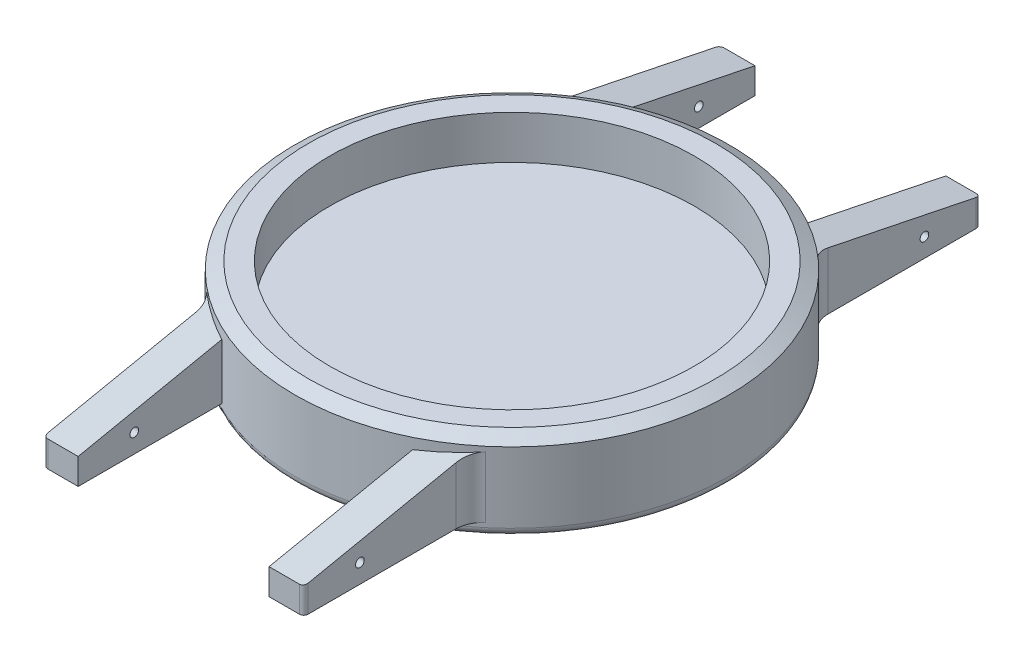
ISO-10303-21;
HEADER;
FILE_DESCRIPTION(('STEP AP214'),'2;1');
FILE_NAME('part.step','',(''),(''),'','','');
FILE_SCHEMA(('AUTOMOTIVE_DESIGN { 1 0 10303 214 1 1 1 1 }'));
ENDSEC;
DATA;
#1=APPLICATION_CONTEXT('core data for automotive mechanical design processes');
#2=APPLICATION_PROTOCOL_DEFINITION('international standard','automotive_design',2000,#1);
#3=PRODUCT_CONTEXT('',#1,'mechanical');
#4=PRODUCT('Part','Part','',(#3));
#5=PRODUCT_RELATED_PRODUCT_CATEGORY('part','',(#4));
#6=PRODUCT_DEFINITION_FORMATION('','',#4);
#7=PRODUCT_DEFINITION_CONTEXT('part definition',#1,'design');
#8=PRODUCT_DEFINITION('design','',#6,#7);
#9=PRODUCT_DEFINITION_SHAPE('','',#8);
#10=(LENGTH_UNIT() NAMED_UNIT(*) SI_UNIT(.MILLI.,.METRE.));
#11=(NAMED_UNIT(*) PLANE_ANGLE_UNIT() SI_UNIT($,.RADIAN.));
#12=(NAMED_UNIT(*) SI_UNIT($,.STERADIAN.) SOLID_ANGLE_UNIT());
#13=UNCERTAINTY_MEASURE_WITH_UNIT(LENGTH_MEASURE(1.E-05),#10,'distance_accuracy_value','');
#14=(GEOMETRIC_REPRESENTATION_CONTEXT(3) GLOBAL_UNCERTAINTY_ASSIGNED_CONTEXT((#13)) GLOBAL_UNIT_ASSIGNED_CONTEXT((#10,
#11,#12)) REPRESENTATION_CONTEXT('',''));
#15=CARTESIAN_POINT('',(0.,0.,0.));
#16=DIRECTION('',(0.,0.,1.));
#17=DIRECTION('',(1.,0.,0.));
#18=AXIS2_PLACEMENT_3D('',#15,#16,#17);
#19=CARTESIAN_POINT('',(-30.,-17.,-78.));
#20=DIRECTION('',(0.,-1.,0.));
#21=DIRECTION('',(0.,0.,-1.));
#22=AXIS2_PLACEMENT_3D('',#19,#20,#21);
#23=PLANE('',#22);
#24=DIRECTION('',(0.,0.,-1.));
#25=VECTOR('',#24,1.);
#26=CARTESIAN_POINT('',(-30.,-17.,-78.));
#27=LINE('',#26,#25);
#28=CARTESIAN_POINT('',(-30.,-17.,-42.8952211790544));
#29=VERTEX_POINT('',#28);
#30=CARTESIAN_POINT('',(-30.,-17.,-77.));
#31=VERTEX_POINT('',#30);
#32=EDGE_CURVE('E236',#29,#31,#27,.T.);
#33=ORIENTED_EDGE('',*,*,#32,.T.);
#34=CARTESIAN_POINT('',(-29.,-17.,-77.));
#35=DIRECTION('',(0.,-1.,0.));
#36=DIRECTION('',(0.,0.,-1.));
#37=AXIS2_PLACEMENT_3D('',#34,#35,#36);
#38=CIRCLE('',#37,1.);
#39=CARTESIAN_POINT('',(-29.,-17.,-78.));
#40=VERTEX_POINT('',#39);
#41=EDGE_CURVE('E11',#31,#40,#38,.T.);
#42=ORIENTED_EDGE('',*,*,#41,.T.);
#43=DIRECTION('',(1.,0.,0.));
#44=VECTOR('',#43,1.);
#45=CARTESIAN_POINT('',(-30.,-17.,-78.));
#46=LINE('',#45,#44);
#47=CARTESIAN_POINT('',(-22.,-17.,-78.));
#48=VERTEX_POINT('',#47);
#49=EDGE_CURVE('E245',#40,#48,#46,.T.);
#50=ORIENTED_EDGE('',*,*,#49,.T.);
#51=DIRECTION('',(0.,0.,-1.));
#52=VECTOR('',#51,1.);
#53=CARTESIAN_POINT('',(-22.,-17.,-78.));
#54=LINE('',#53,#52);
#55=CARTESIAN_POINT('',(-22.,-17.,-44.8998886412873));
#56=VERTEX_POINT('',#55);
#57=EDGE_CURVE('E405',#56,#48,#54,.T.);
#58=ORIENTED_EDGE('',*,*,#57,.F.);
#59=CARTESIAN_POINT('',(0.,-17.,0.));
#60=DIRECTION('',(0.,-1.,0.));
#61=DIRECTION('',(0.,0.,-1.));
#62=AXIS2_PLACEMENT_3D('',#59,#60,#61);
#63=CIRCLE('',#62,50.);
#64=CARTESIAN_POINT('',(-32.1428571428571,-17.,-38.2993046241558));
#65=VERTEX_POINT('',#64);
#66=EDGE_CURVE('E250',#56,#65,#63,.F.);
#67=ORIENTED_EDGE('',*,*,#66,.T.);
#68=CARTESIAN_POINT('',(-36.,-17.,-42.8952211790544));
#69=DIRECTION('',(0.,-1.,0.));
#70=DIRECTION('',(0.,0.,-1.));
#71=AXIS2_PLACEMENT_3D('',#68,#69,#70);
#72=CIRCLE('',#71,6.);
#73=EDGE_CURVE('E316',#65,#29,#72,.F.);
#74=ORIENTED_EDGE('',*,*,#73,.T.);
#75=EDGE_LOOP('',(#33,#42,#50,#58,#67,#74));
#76=FACE_BOUND('',#75,.T.);
#77=ADVANCED_FACE('F36',(#76),#23,.T.);
#78=CARTESIAN_POINT('',(-30.,-11.,-78.));
#79=DIRECTION('',(0.,0.979533569786248,-0.201280862631819));
#80=DIRECTION('',(0.,0.201280862631819,0.979533569786248));
#81=AXIS2_PLACEMENT_3D('',#78,#79,#80);
#82=PLANE('',#81);
#83=DIRECTION('',(1.,0.,0.));
#84=VECTOR('',#83,1.);
#85=CARTESIAN_POINT('',(-30.,-11.,-78.));
#86=LINE('',#85,#84);
#87=CARTESIAN_POINT('',(-29.,-11.,-78.));
#88=VERTEX_POINT('',#87);
#89=CARTESIAN_POINT('',(-22.,-11.,-78.));
#90=VERTEX_POINT('',#89);
#91=EDGE_CURVE('E241',#88,#90,#86,.T.);
#92=ORIENTED_EDGE('',*,*,#91,.F.);
#93=CARTESIAN_POINT('',(-29.,-10.7945135635568,-77.));
#94=DIRECTION('',(0.,0.979533569786248,-0.201280862631819));
#95=DIRECTION('',(0.,0.201280862631819,0.979533569786248));
#96=AXIS2_PLACEMENT_3D('',#93,#94,#95);
#97=ELLIPSE('',#96,1.02089405697267,1.);
#98=CARTESIAN_POINT('',(-30.,-10.7945135635568,-77.));
#99=VERTEX_POINT('',#98);
#100=EDGE_CURVE('E60',#88,#99,#97,.T.);
#101=ORIENTED_EDGE('',*,*,#100,.T.);
#102=DIRECTION('',(0.,0.201280862631819,0.979533569786248));
#103=VECTOR('',#102,1.);
#104=CARTESIAN_POINT('',(-30.,-11.,-78.));
#105=LINE('',#104,#103);
#106=CARTESIAN_POINT('',(-30.,-3.78644409795873,-42.8952211790544));
#107=VERTEX_POINT('',#106);
#108=EDGE_CURVE('E238',#99,#107,#105,.T.);
#109=ORIENTED_EDGE('',*,*,#108,.T.);
#110=CARTESIAN_POINT('',(-36.,-3.78644409795873,-42.8952211790544));
#111=DIRECTION('',(0.,0.979533569786248,-0.201280862631819));
#112=DIRECTION('',(0.,0.201280862631819,0.979533569786248));
#113=AXIS2_PLACEMENT_3D('',#110,#111,#112);
#114=ELLIPSE('',#113,6.12536434183599,6.);
#115=CARTESIAN_POINT('',(-32.1428571428571,-2.8420455829025,-38.2993046241558));
#116=VERTEX_POINT('',#115);
#117=EDGE_CURVE('E313',#107,#116,#114,.F.);
#118=ORIENTED_EDGE('',*,*,#117,.T.);
#119=CARTESIAN_POINT('',(0.,5.02794204256612,0.));
#120=DIRECTION('',(0.,0.979533569786248,-0.201280862631819));
#121=DIRECTION('',(0.,0.201280862631819,0.979533569786248));
#122=AXIS2_PLACEMENT_3D('',#119,#120,#121);
#123=ELLIPSE('',#122,51.0447028486332,50.);
#124=CARTESIAN_POINT('',(-22.,-4.1983760710265,-44.8998886412873));
#125=VERTEX_POINT('',#124);
#126=EDGE_CURVE('E247',#116,#125,#123,.F.);
#127=ORIENTED_EDGE('',*,*,#126,.T.);
#128=DIRECTION('',(0.,0.201280862631819,0.979533569786248));
#129=VECTOR('',#128,1.);
#130=CARTESIAN_POINT('',(-22.,-11.,-78.));
#131=LINE('',#130,#129);
#132=EDGE_CURVE('E403',#90,#125,#131,.T.);
#133=ORIENTED_EDGE('',*,*,#132,.F.);
#134=EDGE_LOOP('',(#92,#101,#109,#118,#127,#133));
#135=FACE_BOUND('',#134,.T.);
#136=ADVANCED_FACE('F454',(#135),#82,.T.);
#137=CARTESIAN_POINT('',(-30.,-17.,-78.));
#138=DIRECTION('',(0.,0.,-1.));
#139=DIRECTION('',(-1.,0.,0.));
#140=AXIS2_PLACEMENT_3D('',#137,#138,#139);
#141=PLANE('',#140);
#142=ORIENTED_EDGE('',*,*,#49,.F.);
#143=DIRECTION('',(0.,1.,0.));
#144=VECTOR('',#143,1.);
#145=CARTESIAN_POINT('',(-29.,-17.,-78.));
#146=LINE('',#145,#144);
#147=EDGE_CURVE('E355',#40,#88,#146,.T.);
#148=ORIENTED_EDGE('',*,*,#147,.T.);
#149=ORIENTED_EDGE('',*,*,#91,.T.);
#150=DIRECTION('',(0.,1.,0.));
#151=VECTOR('',#150,1.);
#152=CARTESIAN_POINT('',(-22.,-17.,-78.));
#153=LINE('',#152,#151);
#154=EDGE_CURVE('E269',#48,#90,#153,.T.);
#155=ORIENTED_EDGE('',*,*,#154,.F.);
#156=EDGE_LOOP('',(#142,#148,#149,#155));
#157=FACE_BOUND('',#156,.T.);
#158=ADVANCED_FACE('F462',(#157),#141,.T.);
#159=CARTESIAN_POINT('',(-30.,-17.,78.));
#160=DIRECTION('',(0.,-1.,0.));
#161=DIRECTION('',(0.,0.,-1.));
#162=AXIS2_PLACEMENT_3D('',#159,#160,#161);
#163=PLANE('',#162);
#164=DIRECTION('',(1.,0.,0.));
#165=VECTOR('',#164,1.);
#166=CARTESIAN_POINT('',(-30.,-17.,78.));
#167=LINE('',#166,#165);
#168=CARTESIAN_POINT('',(-29.,-17.,78.));
#169=VERTEX_POINT('',#168);
#170=CARTESIAN_POINT('',(-22.,-17.,78.));
#171=VERTEX_POINT('',#170);
#172=EDGE_CURVE('E223',#169,#171,#167,.T.);
#173=ORIENTED_EDGE('',*,*,#172,.F.);
#174=CARTESIAN_POINT('',(-29.,-17.,77.));
#175=DIRECTION('',(0.,-1.,0.));
#176=DIRECTION('',(0.,0.,-1.));
#177=AXIS2_PLACEMENT_3D('',#174,#175,#176);
#178=CIRCLE('',#177,1.);
#179=CARTESIAN_POINT('',(-30.,-17.,77.));
#180=VERTEX_POINT('',#179);
#181=EDGE_CURVE('E340',#169,#180,#178,.T.);
#182=ORIENTED_EDGE('',*,*,#181,.T.);
#183=DIRECTION('',(0.,0.,-1.));
#184=VECTOR('',#183,1.);
#185=CARTESIAN_POINT('',(-30.,-17.,78.));
#186=LINE('',#185,#184);
#187=CARTESIAN_POINT('',(-30.,-17.,42.8952211790544));
#188=VERTEX_POINT('',#187);
#189=EDGE_CURVE('E412',#180,#188,#186,.T.);
#190=ORIENTED_EDGE('',*,*,#189,.T.);
#191=CARTESIAN_POINT('',(-36.,-17.,42.8952211790544));
#192=DIRECTION('',(0.,-1.,0.));
#193=DIRECTION('',(0.,0.,-1.));
#194=AXIS2_PLACEMENT_3D('',#191,#192,#193);
#195=CIRCLE('',#194,6.);
#196=CARTESIAN_POINT('',(-32.1428571428571,-17.,38.2993046241558));
#197=VERTEX_POINT('',#196);
#198=EDGE_CURVE('E320',#188,#197,#195,.F.);
#199=ORIENTED_EDGE('',*,*,#198,.T.);
#200=CARTESIAN_POINT('',(0.,-17.,0.));
#201=DIRECTION('',(0.,-1.,0.));
#202=DIRECTION('',(0.,0.,-1.));
#203=AXIS2_PLACEMENT_3D('',#200,#201,#202);
#204=CIRCLE('',#203,50.);
#205=CARTESIAN_POINT('',(-22.,-17.,44.8998886412873));
#206=VERTEX_POINT('',#205);
#207=EDGE_CURVE('E259',#197,#206,#204,.F.);
#208=ORIENTED_EDGE('',*,*,#207,.T.);
#209=DIRECTION('',(0.,0.,-1.));
#210=VECTOR('',#209,1.);
#211=CARTESIAN_POINT('',(-22.,-17.,78.));
#212=LINE('',#211,#210);
#213=EDGE_CURVE('E207',#171,#206,#212,.T.);
#214=ORIENTED_EDGE('',*,*,#213,.F.);
#215=EDGE_LOOP('',(#173,#182,#190,#199,#208,#214));
#216=FACE_BOUND('',#215,.T.);
#217=ADVANCED_FACE('F512',(#216),#163,.T.);
#218=CARTESIAN_POINT('',(-30.,-17.,78.));
#219=DIRECTION('',(0.,0.,1.));
#220=DIRECTION('',(1.,0.,0.));
#221=AXIS2_PLACEMENT_3D('',#218,#219,#220);
#222=PLANE('',#221);
#223=DIRECTION('',(1.,0.,0.));
#224=VECTOR('',#223,1.);
#225=CARTESIAN_POINT('',(-30.,-11.,78.));
#226=LINE('',#225,#224);
#227=CARTESIAN_POINT('',(-29.,-11.,78.));
#228=VERTEX_POINT('',#227);
#229=CARTESIAN_POINT('',(-22.,-11.,78.));
#230=VERTEX_POINT('',#229);
#231=EDGE_CURVE('E224',#228,#230,#226,.T.);
#232=ORIENTED_EDGE('',*,*,#231,.F.);
#233=DIRECTION('',(0.,-1.,0.));
#234=VECTOR('',#233,1.);
#235=CARTESIAN_POINT('',(-29.,-17.,78.));
#236=LINE('',#235,#234);
#237=EDGE_CURVE('E337',#228,#169,#236,.T.);
#238=ORIENTED_EDGE('',*,*,#237,.T.);
#239=ORIENTED_EDGE('',*,*,#172,.T.);
#240=DIRECTION('',(0.,1.,0.));
#241=VECTOR('',#240,1.);
#242=CARTESIAN_POINT('',(-22.,-30.,78.));
#243=LINE('',#242,#241);
#244=EDGE_CURVE('E392',#171,#230,#243,.T.);
#245=ORIENTED_EDGE('',*,*,#244,.T.);
#246=EDGE_LOOP('',(#232,#238,#239,#245));
#247=FACE_BOUND('',#246,.T.);
#248=ADVANCED_FACE('F448',(#247),#222,.T.);
#249=CARTESIAN_POINT('',(-30.,-11.,78.));
#250=DIRECTION('',(0.,0.979533569786248,0.201280862631819));
#251=DIRECTION('',(0.,-0.201280862631819,0.979533569786248));
#252=AXIS2_PLACEMENT_3D('',#249,#250,#251);
#253=PLANE('',#252);
#254=DIRECTION('',(0.,-0.201280862631819,0.979533569786248));
#255=VECTOR('',#254,1.);
#256=CARTESIAN_POINT('',(-30.,-11.,78.));
#257=LINE('',#256,#255);
#258=CARTESIAN_POINT('',(-30.,-3.78644409795874,42.8952211790545));
#259=VERTEX_POINT('',#258);
#260=CARTESIAN_POINT('',(-30.,-10.7945135635568,77.));
#261=VERTEX_POINT('',#260);
#262=EDGE_CURVE('E229',#259,#261,#257,.T.);
#263=ORIENTED_EDGE('',*,*,#262,.T.);
#264=CARTESIAN_POINT('',(-29.,-10.7945135635568,77.));
#265=DIRECTION('',(0.,0.979533569786248,0.201280862631819));
#266=DIRECTION('',(0.,0.201280862631819,-0.979533569786248));
#267=AXIS2_PLACEMENT_3D('',#264,#265,#266);
#268=ELLIPSE('',#267,1.02089405697266,1.);
#269=EDGE_CURVE('E344',#261,#228,#268,.T.);
#270=ORIENTED_EDGE('',*,*,#269,.T.);
#271=ORIENTED_EDGE('',*,*,#231,.T.);
#272=DIRECTION('',(0.,-0.201280862631819,0.979533569786248));
#273=VECTOR('',#272,1.);
#274=CARTESIAN_POINT('',(-22.,-11.,78.));
#275=LINE('',#274,#273);
#276=CARTESIAN_POINT('',(-22.,-4.19837607102652,44.8998886412873));
#277=VERTEX_POINT('',#276);
#278=EDGE_CURVE('E264',#277,#230,#275,.T.);
#279=ORIENTED_EDGE('',*,*,#278,.F.);
#280=CARTESIAN_POINT('',(0.,5.02794204256612,0.));
#281=DIRECTION('',(0.,0.979533569786248,0.201280862631819));
#282=DIRECTION('',(0.,0.201280862631819,-0.979533569786248));
#283=AXIS2_PLACEMENT_3D('',#280,#281,#282);
#284=ELLIPSE('',#283,51.0447028486332,50.);
#285=CARTESIAN_POINT('',(-32.1428571428571,-2.84204558290251,38.2993046241558));
#286=VERTEX_POINT('',#285);
#287=EDGE_CURVE('E254',#277,#286,#284,.F.);
#288=ORIENTED_EDGE('',*,*,#287,.T.);
#289=CARTESIAN_POINT('',(-36.,-3.78644409795874,42.8952211790544));
#290=DIRECTION('',(0.,0.979533569786248,0.201280862631819));
#291=DIRECTION('',(0.,0.201280862631819,-0.979533569786248));
#292=AXIS2_PLACEMENT_3D('',#289,#290,#291);
#293=ELLIPSE('',#292,6.12536434183599,6.);
#294=EDGE_CURVE('E318',#286,#259,#293,.F.);
#295=ORIENTED_EDGE('',*,*,#294,.T.);
#296=EDGE_LOOP('',(#263,#270,#271,#279,#288,#295));
#297=FACE_BOUND('',#296,.T.);
#298=ADVANCED_FACE('F437',(#297),#253,.T.);
#299=CARTESIAN_POINT('',(0.,-20.,0.));
#300=DIRECTION('',(0.,1.,0.));
#301=DIRECTION('',(0.,0.,1.));
#302=AXIS2_PLACEMENT_3D('',#299,#300,#301);
#303=CYLINDRICAL_SURFACE('',#302,50.);
#304=CARTESIAN_POINT('',(0.,-18.,0.));
#305=DIRECTION('',(0.,1.,0.));
#306=DIRECTION('',(0.,0.,1.));
#307=AXIS2_PLACEMENT_3D('',#304,#305,#306);
#308=CIRCLE('',#307,50.);
#309=CARTESIAN_POINT('',(0.,-18.,50.));
#310=VERTEX_POINT('',#309);
#311=EDGE_CURVE('E323',#310,#310,#308,.T.);
#312=ORIENTED_EDGE('',*,*,#311,.T.);
#313=EDGE_LOOP('',(#312));
#314=FACE_BOUND('',#313,.T.);
#315=CARTESIAN_POINT('',(0.,-1.75000000000001,0.));
#316=DIRECTION('',(0.,1.,0.));
#317=DIRECTION('',(0.,0.,1.));
#318=AXIS2_PLACEMENT_3D('',#315,#316,#317);
#319=CIRCLE('',#318,50.);
#320=CARTESIAN_POINT('',(0.,-1.75000000000001,50.));
#321=VERTEX_POINT('',#320);
#322=EDGE_CURVE('E275',#321,#321,#319,.F.);
#323=ORIENTED_EDGE('',*,*,#322,.T.);
#324=EDGE_LOOP('',(#323));
#325=FACE_BOUND('',#324,.T.);
#326=ORIENTED_EDGE('',*,*,#126,.F.);
#327=DIRECTION('',(0.,1.,0.));
#328=VECTOR('',#327,1.);
#329=CARTESIAN_POINT('',(-32.1428571428571,-20.,-38.2993046241558));
#330=LINE('',#329,#328);
#331=EDGE_CURVE('E293',#116,#65,#330,.F.);
#332=ORIENTED_EDGE('',*,*,#331,.T.);
#333=ORIENTED_EDGE('',*,*,#66,.F.);
#334=DIRECTION('',(0.,1.,0.));
#335=VECTOR('',#334,1.);
#336=CARTESIAN_POINT('',(-22.,-30.,-44.8998886412873));
#337=LINE('',#336,#335);
#338=EDGE_CURVE('E389',#56,#125,#337,.T.);
#339=ORIENTED_EDGE('',*,*,#338,.T.);
#340=EDGE_LOOP('',(#326,#332,#333,#339));
#341=FACE_BOUND('',#340,.T.);
#342=DIRECTION('',(0.,1.,0.));
#343=VECTOR('',#342,1.);
#344=CARTESIAN_POINT('',(32.1428571428571,-20.,-38.2993046241558));
#345=LINE('',#344,#343);
#346=CARTESIAN_POINT('',(32.1428571428571,-17.,-38.2993046241558));
#347=VERTEX_POINT('',#346);
#348=CARTESIAN_POINT('',(32.1428571428571,-2.8420455829025,-38.2993046241558));
#349=VERTEX_POINT('',#348);
#350=EDGE_CURVE('E296',#347,#349,#345,.T.);
#351=ORIENTED_EDGE('',*,*,#350,.T.);
#352=CARTESIAN_POINT('',(22.,-4.19837607102651,-44.8998886412873));
#353=VERTEX_POINT('',#352);
#354=EDGE_CURVE('E243',#353,#349,#123,.F.);
#355=ORIENTED_EDGE('',*,*,#354,.F.);
#356=DIRECTION('',(0.,1.,0.));
#357=VECTOR('',#356,1.);
#358=CARTESIAN_POINT('',(22.,-30.,-44.8998886412873));
#359=LINE('',#358,#357);
#360=CARTESIAN_POINT('',(22.,-17.,-44.8998886412873));
#361=VERTEX_POINT('',#360);
#362=EDGE_CURVE('E208',#361,#353,#359,.T.);
#363=ORIENTED_EDGE('',*,*,#362,.F.);
#364=EDGE_CURVE('E251',#347,#361,#63,.F.);
#365=ORIENTED_EDGE('',*,*,#364,.F.);
#366=EDGE_LOOP('',(#351,#355,#363,#365));
#367=FACE_BOUND('',#366,.T.);
#368=DIRECTION('',(0.,1.,0.));
#369=VECTOR('',#368,1.);
#370=CARTESIAN_POINT('',(-32.1428571428571,-20.,38.2993046241558));
#371=LINE('',#370,#369);
#372=EDGE_CURVE('E290',#197,#286,#371,.T.);
#373=ORIENTED_EDGE('',*,*,#372,.T.);
#374=ORIENTED_EDGE('',*,*,#287,.F.);
#375=DIRECTION('',(0.,1.,0.));
#376=VECTOR('',#375,1.);
#377=CARTESIAN_POINT('',(-22.,-30.,44.8998886412873));
#378=LINE('',#377,#376);
#379=EDGE_CURVE('E395',#206,#277,#378,.T.);
#380=ORIENTED_EDGE('',*,*,#379,.F.);
#381=ORIENTED_EDGE('',*,*,#207,.F.);
#382=EDGE_LOOP('',(#373,#374,#380,#381));
#383=FACE_BOUND('',#382,.T.);
#384=CARTESIAN_POINT('',(32.1428571428571,-2.84204558290251,38.2993046241558));
#385=VERTEX_POINT('',#384);
#386=CARTESIAN_POINT('',(22.,-4.19837607102652,44.8998886412873));
#387=VERTEX_POINT('',#386);
#388=EDGE_CURVE('E255',#385,#387,#284,.F.);
#389=ORIENTED_EDGE('',*,*,#388,.F.);
#390=DIRECTION('',(0.,1.,0.));
#391=VECTOR('',#390,1.);
#392=CARTESIAN_POINT('',(32.1428571428571,-20.,38.2993046241558));
#393=LINE('',#392,#391);
#394=CARTESIAN_POINT('',(32.1428571428571,-17.,38.2993046241558));
#395=VERTEX_POINT('',#394);
#396=EDGE_CURVE('E281',#385,#395,#393,.F.);
#397=ORIENTED_EDGE('',*,*,#396,.T.);
#398=CARTESIAN_POINT('',(22.,-17.,44.8998886412873));
#399=VERTEX_POINT('',#398);
#400=EDGE_CURVE('E258',#399,#395,#204,.F.);
#401=ORIENTED_EDGE('',*,*,#400,.F.);
#402=DIRECTION('',(0.,1.,0.));
#403=VECTOR('',#402,1.);
#404=CARTESIAN_POINT('',(22.,-30.,44.8998886412873));
#405=LINE('',#404,#403);
#406=EDGE_CURVE('E203',#399,#387,#405,.T.);
#407=ORIENTED_EDGE('',*,*,#406,.T.);
#408=EDGE_LOOP('',(#389,#397,#401,#407));
#409=FACE_BOUND('',#408,.T.);
#410=ADVANCED_FACE('F434',(#314,#325,#341,#367,#383,#409),#303,.T.);
#411=CARTESIAN_POINT('',(0.,-20.,0.));
#412=DIRECTION('',(0.,1.,0.));
#413=DIRECTION('',(0.,0.,1.));
#414=AXIS2_PLACEMENT_3D('',#411,#412,#413);
#415=PLANE('',#414);
#416=CARTESIAN_POINT('',(0.,-20.,0.));
#417=DIRECTION('',(0.,1.,0.));
#418=DIRECTION('',(0.,0.,1.));
#419=AXIS2_PLACEMENT_3D('',#416,#417,#418);
#420=CIRCLE('',#419,48.);
#421=CARTESIAN_POINT('',(0.,-20.,48.));
#422=VERTEX_POINT('',#421);
#423=EDGE_CURVE('E326',#422,#422,#420,.F.);
#424=ORIENTED_EDGE('',*,*,#423,.T.);
#425=EDGE_LOOP('',(#424));
#426=FACE_BOUND('',#425,.T.);
#427=ADVANCED_FACE('F436',(#426),#415,.F.);
#428=CARTESIAN_POINT('',(0.,0.,0.));
#429=DIRECTION('',(0.,1.,0.));
#430=DIRECTION('',(0.,0.,1.));
#431=AXIS2_PLACEMENT_3D('',#428,#429,#430);
#432=PLANE('',#431);
#433=CARTESIAN_POINT('',(0.,0.,0.));
#434=DIRECTION('',(0.,1.,0.));
#435=DIRECTION('',(0.,0.,1.));
#436=AXIS2_PLACEMENT_3D('',#433,#434,#435);
#437=CIRCLE('',#436,42.);
#438=CARTESIAN_POINT('',(0.,0.,42.));
#439=VERTEX_POINT('',#438);
#440=EDGE_CURVE('E383',#439,#439,#437,.T.);
#441=ORIENTED_EDGE('',*,*,#440,.F.);
#442=EDGE_LOOP('',(#441));
#443=FACE_BOUND('',#442,.T.);
#444=CARTESIAN_POINT('',(0.,0.,0.));
#445=DIRECTION('',(0.,1.,0.));
#446=DIRECTION('',(0.,0.,1.));
#447=AXIS2_PLACEMENT_3D('',#444,#445,#446);
#448=CIRCLE('',#447,46.9689110867545);
#449=CARTESIAN_POINT('',(0.,0.,46.9689110867545));
#450=VERTEX_POINT('',#449);
#451=EDGE_CURVE('E272',#450,#450,#448,.T.);
#452=ORIENTED_EDGE('',*,*,#451,.T.);
#453=EDGE_LOOP('',(#452));
#454=FACE_BOUND('',#453,.T.);
#455=ADVANCED_FACE('F444',(#443,#454),#432,.T.);
#456=CARTESIAN_POINT('',(22.,-17.,-78.));
#457=VERTEX_POINT('',#456);
#458=CARTESIAN_POINT('',(29.,-17.,-78.));
#459=VERTEX_POINT('',#458);
#460=EDGE_CURVE('E240',#457,#459,#46,.T.);
#461=ORIENTED_EDGE('',*,*,#460,.T.);
#462=CARTESIAN_POINT('',(29.,-17.,-77.));
#463=DIRECTION('',(0.,-1.,0.));
#464=DIRECTION('',(0.,0.,-1.));
#465=AXIS2_PLACEMENT_3D('',#462,#463,#464);
#466=CIRCLE('',#465,1.);
#467=CARTESIAN_POINT('',(30.,-17.,-77.));
#468=VERTEX_POINT('',#467);
#469=EDGE_CURVE('E353',#459,#468,#466,.T.);
#470=ORIENTED_EDGE('',*,*,#469,.T.);
#471=DIRECTION('',(0.,0.,-1.));
#472=VECTOR('',#471,1.);
#473=CARTESIAN_POINT('',(30.,-17.,-78.));
#474=LINE('',#473,#472);
#475=CARTESIAN_POINT('',(30.,-17.,-42.8952211790544));
#476=VERTEX_POINT('',#475);
#477=EDGE_CURVE('E226',#476,#468,#474,.T.);
#478=ORIENTED_EDGE('',*,*,#477,.F.);
#479=CARTESIAN_POINT('',(36.,-17.,-42.8952211790544));
#480=DIRECTION('',(0.,-1.,0.));
#481=DIRECTION('',(0.,0.,-1.));
#482=AXIS2_PLACEMENT_3D('',#479,#480,#481);
#483=CIRCLE('',#482,6.);
#484=EDGE_CURVE('E310',#476,#347,#483,.F.);
#485=ORIENTED_EDGE('',*,*,#484,.T.);
#486=ORIENTED_EDGE('',*,*,#364,.T.);
#487=DIRECTION('',(0.,0.,1.));
#488=VECTOR('',#487,1.);
#489=CARTESIAN_POINT('',(22.,-17.,-78.));
#490=LINE('',#489,#488);
#491=EDGE_CURVE('E401',#457,#361,#490,.T.);
#492=ORIENTED_EDGE('',*,*,#491,.F.);
#493=EDGE_LOOP('',(#461,#470,#478,#485,#486,#492));
#494=FACE_BOUND('',#493,.T.);
#495=ADVANCED_FACE('F457',(#494),#23,.T.);
#496=DIRECTION('',(0.,0.201280862631819,0.979533569786248));
#497=VECTOR('',#496,1.);
#498=CARTESIAN_POINT('',(30.,-11.,-78.));
#499=LINE('',#498,#497);
#500=CARTESIAN_POINT('',(30.,-10.7945135635568,-77.));
#501=VERTEX_POINT('',#500);
#502=CARTESIAN_POINT('',(30.,-3.78644409795873,-42.8952211790544));
#503=VERTEX_POINT('',#502);
#504=EDGE_CURVE('E234',#501,#503,#499,.T.);
#505=ORIENTED_EDGE('',*,*,#504,.F.);
#506=CARTESIAN_POINT('',(29.,-10.7945135635568,-77.));
#507=DIRECTION('',(0.,0.979533569786248,-0.201280862631819));
#508=DIRECTION('',(0.,-0.201280862631819,-0.979533569786248));
#509=AXIS2_PLACEMENT_3D('',#506,#507,#508);
#510=ELLIPSE('',#509,1.02089405697267,1.);
#511=CARTESIAN_POINT('',(29.,-11.,-78.));
#512=VERTEX_POINT('',#511);
#513=EDGE_CURVE('E349',#501,#512,#510,.T.);
#514=ORIENTED_EDGE('',*,*,#513,.T.);
#515=CARTESIAN_POINT('',(22.,-11.,-78.));
#516=VERTEX_POINT('',#515);
#517=EDGE_CURVE('E244',#516,#512,#86,.T.);
#518=ORIENTED_EDGE('',*,*,#517,.F.);
#519=DIRECTION('',(0.,-0.201280862631819,-0.979533569786248));
#520=VECTOR('',#519,1.);
#521=CARTESIAN_POINT('',(22.,-11.,-78.));
#522=LINE('',#521,#520);
#523=EDGE_CURVE('E399',#353,#516,#522,.T.);
#524=ORIENTED_EDGE('',*,*,#523,.F.);
#525=ORIENTED_EDGE('',*,*,#354,.T.);
#526=CARTESIAN_POINT('',(36.,-3.78644409795873,-42.8952211790544));
#527=DIRECTION('',(0.,0.979533569786248,-0.201280862631819));
#528=DIRECTION('',(0.,0.201280862631819,0.979533569786248));
#529=AXIS2_PLACEMENT_3D('',#526,#527,#528);
#530=ELLIPSE('',#529,6.12536434183599,6.);
#531=EDGE_CURVE('E307',#349,#503,#530,.F.);
#532=ORIENTED_EDGE('',*,*,#531,.T.);
#533=EDGE_LOOP('',(#505,#514,#518,#524,#525,#532));
#534=FACE_BOUND('',#533,.T.);
#535=ADVANCED_FACE('F464',(#534),#82,.T.);
#536=ORIENTED_EDGE('',*,*,#517,.T.);
#537=DIRECTION('',(0.,1.,0.));
#538=VECTOR('',#537,1.);
#539=CARTESIAN_POINT('',(29.,-17.,-78.));
#540=LINE('',#539,#538);
#541=EDGE_CURVE('E351',#512,#459,#540,.F.);
#542=ORIENTED_EDGE('',*,*,#541,.T.);
#543=ORIENTED_EDGE('',*,*,#460,.F.);
#544=DIRECTION('',(0.,-1.,0.));
#545=VECTOR('',#544,1.);
#546=CARTESIAN_POINT('',(22.,-17.,-78.));
#547=LINE('',#546,#545);
#548=EDGE_CURVE('E267',#516,#457,#547,.T.);
#549=ORIENTED_EDGE('',*,*,#548,.F.);
#550=EDGE_LOOP('',(#536,#542,#543,#549));
#551=FACE_BOUND('',#550,.T.);
#552=ADVANCED_FACE('F471',(#551),#141,.T.);
#553=CARTESIAN_POINT('',(-30.,0.,0.));
#554=DIRECTION('',(-1.,0.,0.));
#555=DIRECTION('',(0.,0.,1.));
#556=AXIS2_PLACEMENT_3D('',#553,#554,#555);
#557=PLANE('',#556);
#558=CARTESIAN_POINT('',(-30.,-12.6707945404755,-65.0628399369591));
#559=DIRECTION('',(-1.,0.,0.));
#560=DIRECTION('',(0.,0.,1.));
#561=AXIS2_PLACEMENT_3D('',#558,#559,#560);
#562=CIRCLE('',#561,0.999999999999998);
#563=CARTESIAN_POINT('',(-30.,-12.6707945404755,-64.0628399369591));
#564=VERTEX_POINT('',#563);
#565=EDGE_CURVE('E362',#564,#564,#562,.F.);
#566=ORIENTED_EDGE('',*,*,#565,.T.);
#567=EDGE_LOOP('',(#566));
#568=FACE_BOUND('',#567,.T.);
#569=ORIENTED_EDGE('',*,*,#108,.F.);
#570=DIRECTION('',(0.,1.,0.));
#571=VECTOR('',#570,1.);
#572=CARTESIAN_POINT('',(-30.,0.,-77.));
#573=LINE('',#572,#571);
#574=EDGE_CURVE('E45',#99,#31,#573,.F.);
#575=ORIENTED_EDGE('',*,*,#574,.T.);
#576=ORIENTED_EDGE('',*,*,#32,.F.);
#577=DIRECTION('',(0.,-1.,0.));
#578=VECTOR('',#577,1.);
#579=CARTESIAN_POINT('',(-30.,-3.19151541516009,-42.8952211790544));
#580=LINE('',#579,#578);
#581=EDGE_CURVE('E301',#29,#107,#580,.F.);
#582=ORIENTED_EDGE('',*,*,#581,.T.);
#583=EDGE_LOOP('',(#569,#575,#576,#582));
#584=FACE_BOUND('',#583,.T.);
#585=ADVANCED_FACE('F505',(#568,#584),#557,.T.);
#586=CARTESIAN_POINT('',(30.,0.,0.));
#587=DIRECTION('',(-1.,0.,0.));
#588=DIRECTION('',(0.,0.,1.));
#589=AXIS2_PLACEMENT_3D('',#586,#587,#588);
#590=PLANE('',#589);
#591=CARTESIAN_POINT('',(30.,-12.6707945404755,-65.0628399369591));
#592=DIRECTION('',(-1.,0.,0.));
#593=DIRECTION('',(0.,0.,1.));
#594=AXIS2_PLACEMENT_3D('',#591,#592,#593);
#595=CIRCLE('',#594,0.999999999999998);
#596=CARTESIAN_POINT('',(30.,-12.6707945404755,-64.0628399369591));
#597=VERTEX_POINT('',#596);
#598=EDGE_CURVE('E369',#597,#597,#595,.F.);
#599=ORIENTED_EDGE('',*,*,#598,.F.);
#600=EDGE_LOOP('',(#599));
#601=FACE_BOUND('',#600,.T.);
#602=ORIENTED_EDGE('',*,*,#477,.T.);
#603=DIRECTION('',(0.,1.,0.));
#604=VECTOR('',#603,1.);
#605=CARTESIAN_POINT('',(30.,-11.,-77.));
#606=LINE('',#605,#604);
#607=EDGE_CURVE('E346',#468,#501,#606,.T.);
#608=ORIENTED_EDGE('',*,*,#607,.T.);
#609=ORIENTED_EDGE('',*,*,#504,.T.);
#610=DIRECTION('',(0.,1.,0.));
#611=VECTOR('',#610,1.);
#612=CARTESIAN_POINT('',(30.,0.,-42.8952211790544));
#613=LINE('',#612,#611);
#614=EDGE_CURVE('E299',#503,#476,#613,.F.);
#615=ORIENTED_EDGE('',*,*,#614,.T.);
#616=EDGE_LOOP('',(#602,#608,#609,#615));
#617=FACE_BOUND('',#616,.T.);
#618=ADVANCED_FACE('F488',(#601,#617),#590,.F.);
#619=DIRECTION('',(0.,0.,-1.));
#620=VECTOR('',#619,1.);
#621=CARTESIAN_POINT('',(30.,-17.,78.));
#622=LINE('',#621,#620);
#623=CARTESIAN_POINT('',(30.,-17.,77.));
#624=VERTEX_POINT('',#623);
#625=CARTESIAN_POINT('',(30.,-17.,42.8952211790544));
#626=VERTEX_POINT('',#625);
#627=EDGE_CURVE('E408',#624,#626,#622,.T.);
#628=ORIENTED_EDGE('',*,*,#627,.F.);
#629=CARTESIAN_POINT('',(29.,-17.,77.));
#630=DIRECTION('',(0.,-1.,0.));
#631=DIRECTION('',(0.,0.,-1.));
#632=AXIS2_PLACEMENT_3D('',#629,#630,#631);
#633=CIRCLE('',#632,1.);
#634=CARTESIAN_POINT('',(29.,-17.,78.));
#635=VERTEX_POINT('',#634);
#636=EDGE_CURVE('E222',#624,#635,#633,.T.);
#637=ORIENTED_EDGE('',*,*,#636,.T.);
#638=CARTESIAN_POINT('',(22.,-17.,78.));
#639=VERTEX_POINT('',#638);
#640=EDGE_CURVE('E214',#639,#635,#167,.T.);
#641=ORIENTED_EDGE('',*,*,#640,.F.);
#642=DIRECTION('',(0.,0.,1.));
#643=VECTOR('',#642,1.);
#644=CARTESIAN_POINT('',(22.,-17.,78.));
#645=LINE('',#644,#643);
#646=EDGE_CURVE('E197',#399,#639,#645,.T.);
#647=ORIENTED_EDGE('',*,*,#646,.F.);
#648=ORIENTED_EDGE('',*,*,#400,.T.);
#649=CARTESIAN_POINT('',(36.,-17.,42.8952211790544));
#650=DIRECTION('',(0.,-1.,0.));
#651=DIRECTION('',(0.,0.,-1.));
#652=AXIS2_PLACEMENT_3D('',#649,#650,#651);
#653=CIRCLE('',#652,6.);
#654=EDGE_CURVE('E287',#395,#626,#653,.F.);
#655=ORIENTED_EDGE('',*,*,#654,.T.);
#656=EDGE_LOOP('',(#628,#637,#641,#647,#648,#655));
#657=FACE_BOUND('',#656,.T.);
#658=ADVANCED_FACE('F221',(#657),#163,.T.);
#659=ORIENTED_EDGE('',*,*,#640,.T.);
#660=DIRECTION('',(0.,-1.,0.));
#661=VECTOR('',#660,1.);
#662=CARTESIAN_POINT('',(29.,-17.,78.));
#663=LINE('',#662,#661);
#664=CARTESIAN_POINT('',(29.,-11.,78.));
#665=VERTEX_POINT('',#664);
#666=EDGE_CURVE('E333',#635,#665,#663,.F.);
#667=ORIENTED_EDGE('',*,*,#666,.T.);
#668=CARTESIAN_POINT('',(22.,-11.,78.));
#669=VERTEX_POINT('',#668);
#670=EDGE_CURVE('E217',#669,#665,#226,.T.);
#671=ORIENTED_EDGE('',*,*,#670,.F.);
#672=DIRECTION('',(0.,1.,0.));
#673=VECTOR('',#672,1.);
#674=CARTESIAN_POINT('',(22.,-30.,78.));
#675=LINE('',#674,#673);
#676=EDGE_CURVE('E200',#639,#669,#675,.T.);
#677=ORIENTED_EDGE('',*,*,#676,.F.);
#678=EDGE_LOOP('',(#659,#667,#671,#677));
#679=FACE_BOUND('',#678,.T.);
#680=ADVANCED_FACE('F213',(#679),#222,.T.);
#681=ORIENTED_EDGE('',*,*,#670,.T.);
#682=CARTESIAN_POINT('',(29.,-10.7945135635568,77.));
#683=DIRECTION('',(0.,0.979533569786248,0.201280862631819));
#684=DIRECTION('',(0.,-0.201280862631819,0.979533569786248));
#685=AXIS2_PLACEMENT_3D('',#682,#683,#684);
#686=ELLIPSE('',#685,1.02089405697266,1.);
#687=CARTESIAN_POINT('',(30.,-10.7945135635568,77.));
#688=VERTEX_POINT('',#687);
#689=EDGE_CURVE('E335',#665,#688,#686,.T.);
#690=ORIENTED_EDGE('',*,*,#689,.T.);
#691=DIRECTION('',(0.,-0.201280862631819,0.979533569786248));
#692=VECTOR('',#691,1.);
#693=CARTESIAN_POINT('',(30.,-11.,78.));
#694=LINE('',#693,#692);
#695=CARTESIAN_POINT('',(30.,-3.78644409795874,42.8952211790545));
#696=VERTEX_POINT('',#695);
#697=EDGE_CURVE('E410',#696,#688,#694,.T.);
#698=ORIENTED_EDGE('',*,*,#697,.F.);
#699=CARTESIAN_POINT('',(36.,-3.78644409795874,42.8952211790544));
#700=DIRECTION('',(0.,0.979533569786248,0.201280862631819));
#701=DIRECTION('',(0.,0.201280862631819,-0.979533569786248));
#702=AXIS2_PLACEMENT_3D('',#699,#700,#701);
#703=ELLIPSE('',#702,6.12536434183599,6.);
#704=EDGE_CURVE('E284',#696,#385,#703,.F.);
#705=ORIENTED_EDGE('',*,*,#704,.T.);
#706=ORIENTED_EDGE('',*,*,#388,.T.);
#707=DIRECTION('',(0.,0.201280862631819,-0.979533569786248));
#708=VECTOR('',#707,1.);
#709=CARTESIAN_POINT('',(22.,-11.,78.));
#710=LINE('',#709,#708);
#711=EDGE_CURVE('E262',#669,#387,#710,.T.);
#712=ORIENTED_EDGE('',*,*,#711,.F.);
#713=EDGE_LOOP('',(#681,#690,#698,#705,#706,#712));
#714=FACE_BOUND('',#713,.T.);
#715=ADVANCED_FACE('F421',(#714),#253,.T.);
#716=CARTESIAN_POINT('',(-30.,0.,0.));
#717=DIRECTION('',(1.,0.,0.));
#718=DIRECTION('',(0.,0.,-1.));
#719=AXIS2_PLACEMENT_3D('',#716,#717,#718);
#720=PLANE('',#719);
#721=CARTESIAN_POINT('',(-30.,-12.6707945404755,65.0628399369591));
#722=DIRECTION('',(1.,0.,0.));
#723=DIRECTION('',(0.,0.,-1.));
#724=AXIS2_PLACEMENT_3D('',#721,#722,#723);
#725=CIRCLE('',#724,0.999999999999998);
#726=CARTESIAN_POINT('',(-30.,-12.6707945404755,64.0628399369591));
#727=VERTEX_POINT('',#726);
#728=EDGE_CURVE('E380',#727,#727,#725,.F.);
#729=ORIENTED_EDGE('',*,*,#728,.F.);
#730=EDGE_LOOP('',(#729));
#731=FACE_BOUND('',#730,.T.);
#732=ORIENTED_EDGE('',*,*,#189,.F.);
#733=DIRECTION('',(0.,-1.,0.));
#734=VECTOR('',#733,1.);
#735=CARTESIAN_POINT('',(-30.,-11.,77.));
#736=LINE('',#735,#734);
#737=EDGE_CURVE('E342',#180,#261,#736,.F.);
#738=ORIENTED_EDGE('',*,*,#737,.T.);
#739=ORIENTED_EDGE('',*,*,#262,.F.);
#740=DIRECTION('',(0.,1.,0.));
#741=VECTOR('',#740,1.);
#742=CARTESIAN_POINT('',(-30.,0.,42.8952211790544));
#743=LINE('',#742,#741);
#744=EDGE_CURVE('E304',#259,#188,#743,.F.);
#745=ORIENTED_EDGE('',*,*,#744,.T.);
#746=EDGE_LOOP('',(#732,#738,#739,#745));
#747=FACE_BOUND('',#746,.T.);
#748=ADVANCED_FACE('F557',(#731,#747),#720,.F.);
#749=CARTESIAN_POINT('',(30.,0.,0.));
#750=DIRECTION('',(1.,0.,0.));
#751=DIRECTION('',(0.,0.,-1.));
#752=AXIS2_PLACEMENT_3D('',#749,#750,#751);
#753=PLANE('',#752);
#754=CARTESIAN_POINT('',(30.,-12.6707945404755,65.0628399369591));
#755=DIRECTION('',(1.,0.,0.));
#756=DIRECTION('',(0.,0.,-1.));
#757=AXIS2_PLACEMENT_3D('',#754,#755,#756);
#758=CIRCLE('',#757,0.999999999999998);
#759=CARTESIAN_POINT('',(30.,-12.6707945404755,64.0628399369591));
#760=VERTEX_POINT('',#759);
#761=EDGE_CURVE('E366',#760,#760,#758,.F.);
#762=ORIENTED_EDGE('',*,*,#761,.T.);
#763=EDGE_LOOP('',(#762));
#764=FACE_BOUND('',#763,.T.);
#765=ORIENTED_EDGE('',*,*,#697,.T.);
#766=DIRECTION('',(0.,-1.,0.));
#767=VECTOR('',#766,1.);
#768=CARTESIAN_POINT('',(30.,0.,77.));
#769=LINE('',#768,#767);
#770=EDGE_CURVE('E329',#688,#624,#769,.T.);
#771=ORIENTED_EDGE('',*,*,#770,.T.);
#772=ORIENTED_EDGE('',*,*,#627,.T.);
#773=DIRECTION('',(0.,-1.,0.));
#774=VECTOR('',#773,1.);
#775=CARTESIAN_POINT('',(30.,-3.1915154151601,42.8952211790544));
#776=LINE('',#775,#774);
#777=EDGE_CURVE('E278',#626,#696,#776,.F.);
#778=ORIENTED_EDGE('',*,*,#777,.T.);
#779=EDGE_LOOP('',(#765,#771,#772,#778));
#780=FACE_BOUND('',#779,.T.);
#781=ADVANCED_FACE('F427',(#764,#780),#753,.T.);
#782=CARTESIAN_POINT('',(-22.,-30.,78.));
#783=DIRECTION('',(-1.,0.,0.));
#784=DIRECTION('',(0.,0.,1.));
#785=AXIS2_PLACEMENT_3D('',#782,#783,#784);
#786=PLANE('',#785);
#787=CARTESIAN_POINT('',(-22.,-12.6707945404755,65.0628399369591));
#788=DIRECTION('',(-1.,0.,0.));
#789=DIRECTION('',(0.,0.,1.));
#790=AXIS2_PLACEMENT_3D('',#787,#788,#789);
#791=CIRCLE('',#790,0.999999999999998);
#792=CARTESIAN_POINT('',(-22.,-12.6707945404755,66.0628399369591));
#793=VERTEX_POINT('',#792);
#794=EDGE_CURVE('E361',#793,#793,#791,.F.);
#795=ORIENTED_EDGE('',*,*,#794,.F.);
#796=EDGE_LOOP('',(#795));
#797=FACE_BOUND('',#796,.T.);
#798=ORIENTED_EDGE('',*,*,#213,.T.);
#799=ORIENTED_EDGE('',*,*,#379,.T.);
#800=ORIENTED_EDGE('',*,*,#278,.T.);
#801=ORIENTED_EDGE('',*,*,#244,.F.);
#802=EDGE_LOOP('',(#798,#799,#800,#801));
#803=FACE_BOUND('',#802,.T.);
#804=ADVANCED_FACE('F546',(#797,#803),#786,.F.);
#805=CARTESIAN_POINT('',(22.,-30.,78.));
#806=DIRECTION('',(1.,0.,0.));
#807=DIRECTION('',(0.,0.,-1.));
#808=AXIS2_PLACEMENT_3D('',#805,#806,#807);
#809=PLANE('',#808);
#810=CARTESIAN_POINT('',(22.,-12.6707945404755,65.0628399369591));
#811=DIRECTION('',(1.,0.,0.));
#812=DIRECTION('',(0.,0.,-1.));
#813=AXIS2_PLACEMENT_3D('',#810,#811,#812);
#814=CIRCLE('',#813,0.999999999999998);
#815=CARTESIAN_POINT('',(22.,-12.6707945404755,64.0628399369591));
#816=VERTEX_POINT('',#815);
#817=EDGE_CURVE('E359',#816,#816,#814,.F.);
#818=ORIENTED_EDGE('',*,*,#817,.F.);
#819=EDGE_LOOP('',(#818));
#820=FACE_BOUND('',#819,.T.);
#821=ORIENTED_EDGE('',*,*,#646,.T.);
#822=ORIENTED_EDGE('',*,*,#676,.T.);
#823=ORIENTED_EDGE('',*,*,#711,.T.);
#824=ORIENTED_EDGE('',*,*,#406,.F.);
#825=EDGE_LOOP('',(#821,#822,#823,#824));
#826=FACE_BOUND('',#825,.T.);
#827=ADVANCED_FACE('F199',(#820,#826),#809,.F.);
#828=CARTESIAN_POINT('',(-22.,-30.,-78.));
#829=DIRECTION('',(-1.,0.,0.));
#830=DIRECTION('',(0.,0.,1.));
#831=AXIS2_PLACEMENT_3D('',#828,#829,#830);
#832=PLANE('',#831);
#833=CARTESIAN_POINT('',(-22.,-12.6707945404755,-65.0628399369591));
#834=DIRECTION('',(-1.,0.,0.));
#835=DIRECTION('',(0.,0.,1.));
#836=AXIS2_PLACEMENT_3D('',#833,#834,#835);
#837=CIRCLE('',#836,0.999999999999998);
#838=CARTESIAN_POINT('',(-22.,-12.6707945404755,-64.0628399369591));
#839=VERTEX_POINT('',#838);
#840=EDGE_CURVE('E374',#839,#839,#837,.F.);
#841=ORIENTED_EDGE('',*,*,#840,.F.);
#842=EDGE_LOOP('',(#841));
#843=FACE_BOUND('',#842,.T.);
#844=ORIENTED_EDGE('',*,*,#57,.T.);
#845=ORIENTED_EDGE('',*,*,#154,.T.);
#846=ORIENTED_EDGE('',*,*,#132,.T.);
#847=ORIENTED_EDGE('',*,*,#338,.F.);
#848=EDGE_LOOP('',(#844,#845,#846,#847));
#849=FACE_BOUND('',#848,.T.);
#850=ADVANCED_FACE('F534',(#843,#849),#832,.F.);
#851=CARTESIAN_POINT('',(22.,-30.,-78.));
#852=DIRECTION('',(1.,0.,0.));
#853=DIRECTION('',(0.,0.,-1.));
#854=AXIS2_PLACEMENT_3D('',#851,#852,#853);
#855=PLANE('',#854);
#856=CARTESIAN_POINT('',(22.,-12.6707945404755,-65.0628399369591));
#857=DIRECTION('',(1.,0.,0.));
#858=DIRECTION('',(0.,0.,-1.));
#859=AXIS2_PLACEMENT_3D('',#856,#857,#858);
#860=CIRCLE('',#859,0.999999999999998);
#861=CARTESIAN_POINT('',(22.,-12.6707945404755,-66.0628399369591));
#862=VERTEX_POINT('',#861);
#863=EDGE_CURVE('E40',#862,#862,#860,.F.);
#864=ORIENTED_EDGE('',*,*,#863,.F.);
#865=EDGE_LOOP('',(#864));
#866=FACE_BOUND('',#865,.T.);
#867=ORIENTED_EDGE('',*,*,#491,.T.);
#868=ORIENTED_EDGE('',*,*,#362,.T.);
#869=ORIENTED_EDGE('',*,*,#523,.T.);
#870=ORIENTED_EDGE('',*,*,#548,.T.);
#871=EDGE_LOOP('',(#867,#868,#869,#870));
#872=FACE_BOUND('',#871,.T.);
#873=ADVANCED_FACE('F503',(#866,#872),#855,.F.);
#874=CARTESIAN_POINT('',(0.,0.,0.));
#875=DIRECTION('',(0.,-1.,0.));
#876=DIRECTION('',(0.,0.,-1.));
#877=AXIS2_PLACEMENT_3D('',#874,#875,#876);
#878=CONICAL_SURFACE('',#877,46.9689110867545,1.04719755119659);
#879=ORIENTED_EDGE('',*,*,#322,.F.);
#880=EDGE_LOOP('',(#879));
#881=FACE_BOUND('',#880,.T.);
#882=ORIENTED_EDGE('',*,*,#451,.F.);
#883=EDGE_LOOP('',(#882));
#884=FACE_BOUND('',#883,.T.);
#885=ADVANCED_FACE('F542',(#881,#884),#878,.T.);
#886=CARTESIAN_POINT('',(0.,-10.,0.));
#887=DIRECTION('',(0.,1.,0.));
#888=DIRECTION('',(0.,0.,1.));
#889=AXIS2_PLACEMENT_3D('',#886,#887,#888);
#890=CYLINDRICAL_SURFACE('',#889,42.);
#891=CARTESIAN_POINT('',(0.,-10.,0.));
#892=DIRECTION('',(0.,1.,0.));
#893=DIRECTION('',(0.,0.,1.));
#894=AXIS2_PLACEMENT_3D('',#891,#892,#893);
#895=CIRCLE('',#894,42.);
#896=CARTESIAN_POINT('',(0.,-10.,42.));
#897=VERTEX_POINT('',#896);
#898=EDGE_CURVE('E218',#897,#897,#895,.T.);
#899=ORIENTED_EDGE('',*,*,#898,.F.);
#900=EDGE_LOOP('',(#899));
#901=FACE_BOUND('',#900,.T.);
#902=ORIENTED_EDGE('',*,*,#440,.T.);
#903=EDGE_LOOP('',(#902));
#904=FACE_BOUND('',#903,.T.);
#905=ADVANCED_FACE('F588',(#901,#904),#890,.F.);
#906=CARTESIAN_POINT('',(0.,-10.,0.));
#907=DIRECTION('',(0.,1.,0.));
#908=DIRECTION('',(0.,0.,1.));
#909=AXIS2_PLACEMENT_3D('',#906,#907,#908);
#910=PLANE('',#909);
#911=ORIENTED_EDGE('',*,*,#898,.T.);
#912=EDGE_LOOP('',(#911));
#913=FACE_BOUND('',#912,.T.);
#914=ADVANCED_FACE('F586',(#913),#910,.T.);
#915=CARTESIAN_POINT('',(36.,-20.,42.8952211790544));
#916=DIRECTION('',(0.,1.,0.));
#917=DIRECTION('',(0.,0.,1.));
#918=AXIS2_PLACEMENT_3D('',#915,#916,#917);
#919=CYLINDRICAL_SURFACE('',#918,6.);
#920=ORIENTED_EDGE('',*,*,#654,.F.);
#921=ORIENTED_EDGE('',*,*,#396,.F.);
#922=ORIENTED_EDGE('',*,*,#704,.F.);
#923=ORIENTED_EDGE('',*,*,#777,.F.);
#924=EDGE_LOOP('',(#920,#921,#922,#923));
#925=FACE_BOUND('',#924,.T.);
#926=ADVANCED_FACE('F432',(#925),#919,.F.);
#927=CARTESIAN_POINT('',(36.,-20.,-42.8952211790544));
#928=DIRECTION('',(0.,1.,0.));
#929=DIRECTION('',(0.,0.,1.));
#930=AXIS2_PLACEMENT_3D('',#927,#928,#929);
#931=CYLINDRICAL_SURFACE('',#930,6.);
#932=ORIENTED_EDGE('',*,*,#484,.F.);
#933=ORIENTED_EDGE('',*,*,#614,.F.);
#934=ORIENTED_EDGE('',*,*,#531,.F.);
#935=ORIENTED_EDGE('',*,*,#350,.F.);
#936=EDGE_LOOP('',(#932,#933,#934,#935));
#937=FACE_BOUND('',#936,.T.);
#938=ADVANCED_FACE('F498',(#937),#931,.F.);
#939=CARTESIAN_POINT('',(-36.,-20.,-42.8952211790544));
#940=DIRECTION('',(0.,1.,0.));
#941=DIRECTION('',(0.,0.,1.));
#942=AXIS2_PLACEMENT_3D('',#939,#940,#941);
#943=CYLINDRICAL_SURFACE('',#942,6.);
#944=ORIENTED_EDGE('',*,*,#73,.F.);
#945=ORIENTED_EDGE('',*,*,#331,.F.);
#946=ORIENTED_EDGE('',*,*,#117,.F.);
#947=ORIENTED_EDGE('',*,*,#581,.F.);
#948=EDGE_LOOP('',(#944,#945,#946,#947));
#949=FACE_BOUND('',#948,.T.);
#950=ADVANCED_FACE('F528',(#949),#943,.F.);
#951=CARTESIAN_POINT('',(-36.,-20.,42.8952211790544));
#952=DIRECTION('',(0.,1.,0.));
#953=DIRECTION('',(0.,0.,1.));
#954=AXIS2_PLACEMENT_3D('',#951,#952,#953);
#955=CYLINDRICAL_SURFACE('',#954,6.);
#956=ORIENTED_EDGE('',*,*,#198,.F.);
#957=ORIENTED_EDGE('',*,*,#744,.F.);
#958=ORIENTED_EDGE('',*,*,#294,.F.);
#959=ORIENTED_EDGE('',*,*,#372,.F.);
#960=EDGE_LOOP('',(#956,#957,#958,#959));
#961=FACE_BOUND('',#960,.T.);
#962=ADVANCED_FACE('F613',(#961),#955,.F.);
#963=CARTESIAN_POINT('',(0.,-18.,0.));
#964=DIRECTION('',(0.,1.,0.));
#965=DIRECTION('',(0.,0.,1.));
#966=AXIS2_PLACEMENT_3D('',#963,#964,#965);
#967=TOROIDAL_SURFACE('',#966,48.,2.);
#968=ORIENTED_EDGE('',*,*,#423,.F.);
#969=EDGE_LOOP('',(#968));
#970=FACE_BOUND('',#969,.T.);
#971=ORIENTED_EDGE('',*,*,#311,.F.);
#972=EDGE_LOOP('',(#971));
#973=FACE_BOUND('',#972,.T.);
#974=ADVANCED_FACE('F616',(#970,#973),#967,.T.);
#975=CARTESIAN_POINT('',(29.,0.,77.));
#976=DIRECTION('',(0.,-1.,0.));
#977=DIRECTION('',(0.,0.,-1.));
#978=AXIS2_PLACEMENT_3D('',#975,#976,#977);
#979=CYLINDRICAL_SURFACE('',#978,1.);
#980=ORIENTED_EDGE('',*,*,#689,.F.);
#981=ORIENTED_EDGE('',*,*,#666,.F.);
#982=ORIENTED_EDGE('',*,*,#636,.F.);
#983=ORIENTED_EDGE('',*,*,#770,.F.);
#984=EDGE_LOOP('',(#980,#981,#982,#983));
#985=FACE_BOUND('',#984,.T.);
#986=ADVANCED_FACE('F425',(#985),#979,.T.);
#987=CARTESIAN_POINT('',(-29.,-17.,77.));
#988=DIRECTION('',(0.,1.,0.));
#989=DIRECTION('',(0.,0.,1.));
#990=AXIS2_PLACEMENT_3D('',#987,#988,#989);
#991=CYLINDRICAL_SURFACE('',#990,1.);
#992=ORIENTED_EDGE('',*,*,#269,.F.);
#993=ORIENTED_EDGE('',*,*,#737,.F.);
#994=ORIENTED_EDGE('',*,*,#181,.F.);
#995=ORIENTED_EDGE('',*,*,#237,.F.);
#996=EDGE_LOOP('',(#992,#993,#994,#995));
#997=FACE_BOUND('',#996,.T.);
#998=ADVANCED_FACE('F623',(#997),#991,.T.);
#999=CARTESIAN_POINT('',(29.,0.,-77.));
#1000=DIRECTION('',(0.,-1.,0.));
#1001=DIRECTION('',(0.,0.,-1.));
#1002=AXIS2_PLACEMENT_3D('',#999,#1000,#1001);
#1003=CYLINDRICAL_SURFACE('',#1002,1.);
#1004=ORIENTED_EDGE('',*,*,#469,.F.);
#1005=ORIENTED_EDGE('',*,*,#541,.F.);
#1006=ORIENTED_EDGE('',*,*,#513,.F.);
#1007=ORIENTED_EDGE('',*,*,#607,.F.);
#1008=EDGE_LOOP('',(#1004,#1005,#1006,#1007));
#1009=FACE_BOUND('',#1008,.T.);
#1010=ADVANCED_FACE('F485',(#1009),#1003,.T.);
#1011=CARTESIAN_POINT('',(-29.,-17.,-77.));
#1012=DIRECTION('',(0.,1.,0.));
#1013=DIRECTION('',(0.,0.,1.));
#1014=AXIS2_PLACEMENT_3D('',#1011,#1012,#1013);
#1015=CYLINDRICAL_SURFACE('',#1014,1.);
#1016=ORIENTED_EDGE('',*,*,#41,.F.);
#1017=ORIENTED_EDGE('',*,*,#574,.F.);
#1018=ORIENTED_EDGE('',*,*,#100,.F.);
#1019=ORIENTED_EDGE('',*,*,#147,.F.);
#1020=EDGE_LOOP('',(#1016,#1017,#1018,#1019));
#1021=FACE_BOUND('',#1020,.T.);
#1022=ADVANCED_FACE('F38',(#1021),#1015,.T.);
#1023=CARTESIAN_POINT('',(50.,-12.6707945404755,65.0628399369591));
#1024=DIRECTION('',(-1.,0.,0.));
#1025=DIRECTION('',(0.,0.,1.));
#1026=AXIS2_PLACEMENT_3D('',#1023,#1024,#1025);
#1027=CYLINDRICAL_SURFACE('',#1026,0.999999999999998);
#1028=ORIENTED_EDGE('',*,*,#761,.F.);
#1029=EDGE_LOOP('',(#1028));
#1030=FACE_BOUND('',#1029,.T.);
#1031=ORIENTED_EDGE('',*,*,#817,.T.);
#1032=EDGE_LOOP('',(#1031));
#1033=FACE_BOUND('',#1032,.T.);
#1034=ADVANCED_FACE('F581',(#1030,#1033),#1027,.F.);
#1035=ORIENTED_EDGE('',*,*,#794,.T.);
#1036=EDGE_LOOP('',(#1035));
#1037=FACE_BOUND('',#1036,.T.);
#1038=ORIENTED_EDGE('',*,*,#728,.T.);
#1039=EDGE_LOOP('',(#1038));
#1040=FACE_BOUND('',#1039,.T.);
#1041=ADVANCED_FACE('F573',(#1037,#1040),#1027,.F.);
#1042=CARTESIAN_POINT('',(55.,-12.6707945404755,-65.0628399369591));
#1043=DIRECTION('',(-1.,0.,0.));
#1044=DIRECTION('',(0.,0.,1.));
#1045=AXIS2_PLACEMENT_3D('',#1042,#1043,#1044);
#1046=CYLINDRICAL_SURFACE('',#1045,0.999999999999998);
#1047=ORIENTED_EDGE('',*,*,#863,.T.);
#1048=EDGE_LOOP('',(#1047));
#1049=FACE_BOUND('',#1048,.T.);
#1050=ORIENTED_EDGE('',*,*,#598,.T.);
#1051=EDGE_LOOP('',(#1050));
#1052=FACE_BOUND('',#1051,.T.);
#1053=ADVANCED_FACE('F570',(#1049,#1052),#1046,.F.);
#1054=ORIENTED_EDGE('',*,*,#565,.F.);
#1055=EDGE_LOOP('',(#1054));
#1056=FACE_BOUND('',#1055,.T.);
#1057=ORIENTED_EDGE('',*,*,#840,.T.);
#1058=EDGE_LOOP('',(#1057));
#1059=FACE_BOUND('',#1058,.T.);
#1060=ADVANCED_FACE('F572',(#1056,#1059),#1046,.F.);
#1061=CLOSED_SHELL('',(#77,#136,#158,#217,#248,#298,#410,#427,#455,#495,#535,#552,#585,#618,
#658,#680,#715,#748,#781,#804,#827,#850,#873,#885,#905,#914,#926,#938,#950,#962,#974,#986,#998,
#1010,#1022,#1034,#1041,#1053,#1060));
#1062=MANIFOLD_SOLID_BREP('B2',#1061);
#1063=ADVANCED_BREP_SHAPE_REPRESENTATION('',(#18,#1062),#14);
#1064=SHAPE_DEFINITION_REPRESENTATION(#9,#1063);
ENDSEC;
END-ISO-10303-21;
